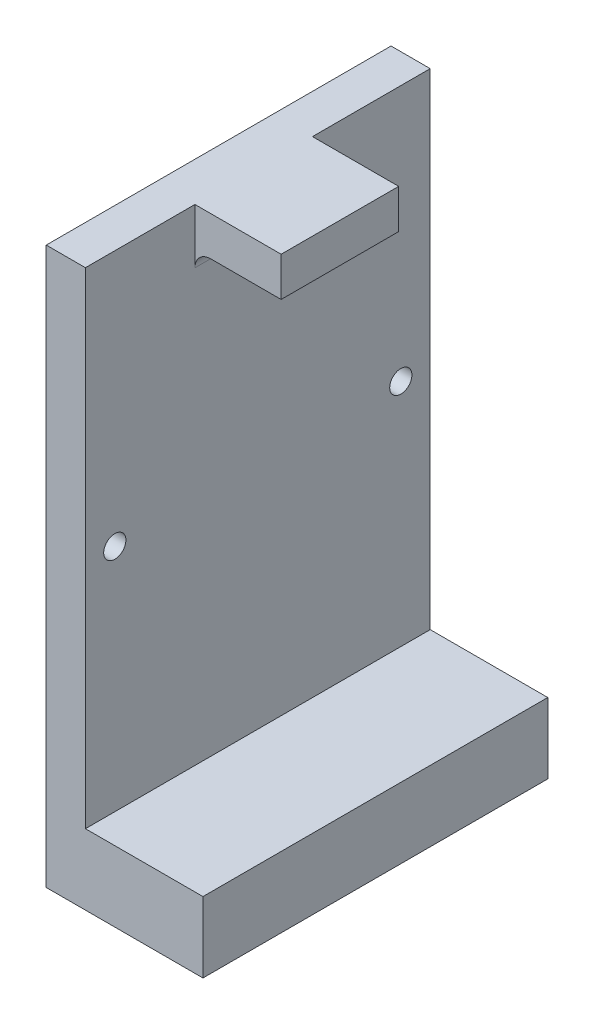
ISO-10303-21;
HEADER;
FILE_DESCRIPTION(('STEP AP214'),'2;1');
FILE_NAME('part.step','',(''),(''),'','','');
FILE_SCHEMA(('AUTOMOTIVE_DESIGN { 1 0 10303 214 1 1 1 1 }'));
ENDSEC;
DATA;
#1=APPLICATION_CONTEXT('core data for automotive mechanical design processes');
#2=APPLICATION_PROTOCOL_DEFINITION('international standard','automotive_design',2000,#1);
#3=PRODUCT_CONTEXT('',#1,'mechanical');
#4=PRODUCT('Part','Part','',(#3));
#5=PRODUCT_RELATED_PRODUCT_CATEGORY('part','',(#4));
#6=PRODUCT_DEFINITION_FORMATION('','',#4);
#7=PRODUCT_DEFINITION_CONTEXT('part definition',#1,'design');
#8=PRODUCT_DEFINITION('design','',#6,#7);
#9=PRODUCT_DEFINITION_SHAPE('','',#8);
#10=(LENGTH_UNIT() NAMED_UNIT(*) SI_UNIT(.MILLI.,.METRE.));
#11=(NAMED_UNIT(*) PLANE_ANGLE_UNIT() SI_UNIT($,.RADIAN.));
#12=(NAMED_UNIT(*) SI_UNIT($,.STERADIAN.) SOLID_ANGLE_UNIT());
#13=UNCERTAINTY_MEASURE_WITH_UNIT(LENGTH_MEASURE(1.E-05),#10,'distance_accuracy_value','');
#14=(GEOMETRIC_REPRESENTATION_CONTEXT(3) GLOBAL_UNCERTAINTY_ASSIGNED_CONTEXT((#13)) GLOBAL_UNIT_ASSIGNED_CONTEXT((#10,
#11,#12)) REPRESENTATION_CONTEXT('',''));
#15=CARTESIAN_POINT('',(0.,0.,0.));
#16=DIRECTION('',(0.,0.,1.));
#17=DIRECTION('',(1.,0.,0.));
#18=AXIS2_PLACEMENT_3D('',#15,#16,#17);
#19=CARTESIAN_POINT('',(-19.05,90.17,-55.88));
#20=DIRECTION('',(-1.,0.,0.));
#21=DIRECTION('',(0.,0.,1.));
#22=AXIS2_PLACEMENT_3D('',#19,#20,#21);
#23=PLANE('',#22);
#24=CARTESIAN_POINT('',(-19.05,48.6672764806341,-4.7625));
#25=DIRECTION('',(1.,0.,0.));
#26=DIRECTION('',(0.,0.,-1.));
#27=AXIS2_PLACEMENT_3D('',#24,#25,#26);
#28=CIRCLE('',#27,1.8);
#29=CARTESIAN_POINT('',(-19.05,48.6672764806341,-6.5625));
#30=VERTEX_POINT('',#29);
#31=EDGE_CURVE('E310',#30,#30,#28,.T.);
#32=ORIENTED_EDGE('',*,*,#31,.F.);
#33=EDGE_LOOP('',(#32));
#34=FACE_BOUND('',#33,.T.);
#35=DIRECTION('',(0.,1.,0.));
#36=VECTOR('',#35,1.);
#37=CARTESIAN_POINT('',(-19.05,90.17,-36.7994645969766));
#38=LINE('',#37,#36);
#39=CARTESIAN_POINT('',(-19.05,81.28,-36.7994645969766));
#40=VERTEX_POINT('',#39);
#41=CARTESIAN_POINT('',(-19.05,90.17,-36.7994645969766));
#42=VERTEX_POINT('',#41);
#43=EDGE_CURVE('E58',#40,#42,#38,.T.);
#44=ORIENTED_EDGE('',*,*,#43,.F.);
#45=DIRECTION('',(0.,0.,-1.));
#46=VECTOR('',#45,1.);
#47=CARTESIAN_POINT('',(-19.05,81.28,-17.7494645969766));
#48=LINE('',#47,#46);
#49=CARTESIAN_POINT('',(-19.05,81.28,-17.7494645969766));
#50=VERTEX_POINT('',#49);
#51=EDGE_CURVE('E228',#40,#50,#48,.F.);
#52=ORIENTED_EDGE('',*,*,#51,.T.);
#53=DIRECTION('',(0.,-1.,0.));
#54=VECTOR('',#53,1.);
#55=CARTESIAN_POINT('',(-19.05,90.17,-17.7494645969766));
#56=LINE('',#55,#54);
#57=CARTESIAN_POINT('',(-19.05,90.17,-17.7494645969766));
#58=VERTEX_POINT('',#57);
#59=EDGE_CURVE('E65',#58,#50,#56,.T.);
#60=ORIENTED_EDGE('',*,*,#59,.F.);
#61=DIRECTION('',(0.,0.,-1.));
#62=VECTOR('',#61,1.);
#63=CARTESIAN_POINT('',(-19.05,90.17,-55.88));
#64=LINE('',#63,#62);
#65=CARTESIAN_POINT('',(-19.05,90.17,0.));
#66=VERTEX_POINT('',#65);
#67=EDGE_CURVE('E170',#66,#58,#64,.T.);
#68=ORIENTED_EDGE('',*,*,#67,.F.);
#69=DIRECTION('',(0.,-1.,0.));
#70=VECTOR('',#69,1.);
#71=CARTESIAN_POINT('',(-19.05,90.17,0.));
#72=LINE('',#71,#70);
#73=CARTESIAN_POINT('',(-19.05,11.43,0.));
#74=VERTEX_POINT('',#73);
#75=EDGE_CURVE('E182',#66,#74,#72,.T.);
#76=ORIENTED_EDGE('',*,*,#75,.T.);
#77=DIRECTION('',(0.,0.,-1.));
#78=VECTOR('',#77,1.);
#79=CARTESIAN_POINT('',(-19.05,11.43,-55.88));
#80=LINE('',#79,#78);
#81=CARTESIAN_POINT('',(-19.05,11.43,-55.88));
#82=VERTEX_POINT('',#81);
#83=EDGE_CURVE('E151',#74,#82,#80,.T.);
#84=ORIENTED_EDGE('',*,*,#83,.T.);
#85=DIRECTION('',(0.,-1.,0.));
#86=VECTOR('',#85,1.);
#87=CARTESIAN_POINT('',(-19.05,90.17,-55.88));
#88=LINE('',#87,#86);
#89=CARTESIAN_POINT('',(-19.05,90.17,-55.88));
#90=VERTEX_POINT('',#89);
#91=EDGE_CURVE('E177',#90,#82,#88,.T.);
#92=ORIENTED_EDGE('',*,*,#91,.F.);
#93=EDGE_CURVE('E169',#42,#90,#64,.T.);
#94=ORIENTED_EDGE('',*,*,#93,.F.);
#95=EDGE_LOOP('',(#44,#52,#60,#68,#76,#84,#92,#94));
#96=FACE_BOUND('',#95,.T.);
#97=CARTESIAN_POINT('',(-19.05,48.6672764806341,-51.1175));
#98=DIRECTION('',(1.,0.,0.));
#99=DIRECTION('',(0.,0.,-1.));
#100=AXIS2_PLACEMENT_3D('',#97,#98,#99);
#101=CIRCLE('',#100,1.8);
#102=CARTESIAN_POINT('',(-19.05,48.6672764806341,-52.9175));
#103=VERTEX_POINT('',#102);
#104=EDGE_CURVE('E315',#103,#103,#101,.T.);
#105=ORIENTED_EDGE('',*,*,#104,.F.);
#106=EDGE_LOOP('',(#105));
#107=FACE_BOUND('',#106,.T.);
#108=ADVANCED_FACE('F42',(#34,#96,#107),#23,.F.);
#109=CARTESIAN_POINT('',(0.,11.43,0.));
#110=DIRECTION('',(-1.,0.,0.));
#111=DIRECTION('',(0.,0.,1.));
#112=AXIS2_PLACEMENT_3D('',#109,#110,#111);
#113=PLANE('',#112);
#114=DIRECTION('',(0.,0.,-1.));
#115=VECTOR('',#114,1.);
#116=CARTESIAN_POINT('',(0.,0.,0.));
#117=LINE('',#116,#115);
#118=CARTESIAN_POINT('',(0.,0.,0.));
#119=VERTEX_POINT('',#118);
#120=CARTESIAN_POINT('',(0.,0.,-55.88));
#121=VERTEX_POINT('',#120);
#122=EDGE_CURVE('E186',#119,#121,#117,.T.);
#123=ORIENTED_EDGE('',*,*,#122,.T.);
#124=DIRECTION('',(0.,-1.,0.));
#125=VECTOR('',#124,1.);
#126=CARTESIAN_POINT('',(0.,11.43,-55.88));
#127=LINE('',#126,#125);
#128=CARTESIAN_POINT('',(0.,11.43,-55.88));
#129=VERTEX_POINT('',#128);
#130=EDGE_CURVE('E221',#129,#121,#127,.T.);
#131=ORIENTED_EDGE('',*,*,#130,.F.);
#132=DIRECTION('',(0.,0.,-1.));
#133=VECTOR('',#132,1.);
#134=CARTESIAN_POINT('',(0.,11.43,0.));
#135=LINE('',#134,#133);
#136=CARTESIAN_POINT('',(0.,11.43,0.));
#137=VERTEX_POINT('',#136);
#138=EDGE_CURVE('E187',#137,#129,#135,.T.);
#139=ORIENTED_EDGE('',*,*,#138,.F.);
#140=DIRECTION('',(0.,-1.,0.));
#141=VECTOR('',#140,1.);
#142=CARTESIAN_POINT('',(0.,11.43,0.));
#143=LINE('',#142,#141);
#144=EDGE_CURVE('E198',#137,#119,#143,.T.);
#145=ORIENTED_EDGE('',*,*,#144,.T.);
#146=EDGE_LOOP('',(#123,#131,#139,#145));
#147=FACE_BOUND('',#146,.T.);
#148=ADVANCED_FACE('F266',(#147),#113,.F.);
#149=CARTESIAN_POINT('',(0.,11.43,-55.88));
#150=DIRECTION('',(0.,0.,1.));
#151=DIRECTION('',(1.,0.,0.));
#152=AXIS2_PLACEMENT_3D('',#149,#150,#151);
#153=PLANE('',#152);
#154=DIRECTION('',(-1.,0.,0.));
#155=VECTOR('',#154,1.);
#156=CARTESIAN_POINT('',(0.,0.,-55.88));
#157=LINE('',#156,#155);
#158=CARTESIAN_POINT('',(-25.4,0.,-55.88));
#159=VERTEX_POINT('',#158);
#160=EDGE_CURVE('E202',#121,#159,#157,.T.);
#161=ORIENTED_EDGE('',*,*,#160,.T.);
#162=DIRECTION('',(0.,-1.,0.));
#163=VECTOR('',#162,1.);
#164=CARTESIAN_POINT('',(-25.4,11.43,-55.88));
#165=LINE('',#164,#163);
#166=CARTESIAN_POINT('',(-25.4,90.17,-55.88));
#167=VERTEX_POINT('',#166);
#168=EDGE_CURVE('E217',#167,#159,#165,.T.);
#169=ORIENTED_EDGE('',*,*,#168,.F.);
#170=DIRECTION('',(-1.,0.,0.));
#171=VECTOR('',#170,1.);
#172=CARTESIAN_POINT('',(-25.4,90.17,-55.88));
#173=LINE('',#172,#171);
#174=EDGE_CURVE('E174',#90,#167,#173,.T.);
#175=ORIENTED_EDGE('',*,*,#174,.F.);
#176=ORIENTED_EDGE('',*,*,#91,.T.);
#177=DIRECTION('',(-1.,0.,0.));
#178=VECTOR('',#177,1.);
#179=CARTESIAN_POINT('',(0.,11.43,-55.88));
#180=LINE('',#179,#178);
#181=EDGE_CURVE('E191',#129,#82,#180,.T.);
#182=ORIENTED_EDGE('',*,*,#181,.F.);
#183=ORIENTED_EDGE('',*,*,#130,.T.);
#184=EDGE_LOOP('',(#161,#169,#175,#176,#182,#183));
#185=FACE_BOUND('',#184,.T.);
#186=ADVANCED_FACE('F256',(#185),#153,.F.);
#187=CARTESIAN_POINT('',(-25.4,11.43,0.));
#188=DIRECTION('',(1.,0.,0.));
#189=DIRECTION('',(0.,0.,-1.));
#190=AXIS2_PLACEMENT_3D('',#187,#188,#189);
#191=PLANE('',#190);
#192=CARTESIAN_POINT('',(-25.4,48.6672764806341,-4.7625));
#193=DIRECTION('',(1.,0.,0.));
#194=DIRECTION('',(0.,0.,-1.));
#195=AXIS2_PLACEMENT_3D('',#192,#193,#194);
#196=CIRCLE('',#195,1.8);
#197=CARTESIAN_POINT('',(-25.4,48.6672764806341,-6.5625));
#198=VERTEX_POINT('',#197);
#199=EDGE_CURVE('E308',#198,#198,#196,.T.);
#200=ORIENTED_EDGE('',*,*,#199,.T.);
#201=EDGE_LOOP('',(#200));
#202=FACE_BOUND('',#201,.T.);
#203=CARTESIAN_POINT('',(-25.4,48.6672764806341,-51.1175));
#204=DIRECTION('',(1.,0.,0.));
#205=DIRECTION('',(0.,0.,-1.));
#206=AXIS2_PLACEMENT_3D('',#203,#204,#205);
#207=CIRCLE('',#206,1.8);
#208=CARTESIAN_POINT('',(-25.4,48.6672764806341,-52.9175));
#209=VERTEX_POINT('',#208);
#210=EDGE_CURVE('E240',#209,#209,#207,.T.);
#211=ORIENTED_EDGE('',*,*,#210,.T.);
#212=EDGE_LOOP('',(#211));
#213=FACE_BOUND('',#212,.T.);
#214=DIRECTION('',(0.,0.,1.));
#215=VECTOR('',#214,1.);
#216=CARTESIAN_POINT('',(-25.4,0.,0.));
#217=LINE('',#216,#215);
#218=CARTESIAN_POINT('',(-25.4,0.,0.));
#219=VERTEX_POINT('',#218);
#220=EDGE_CURVE('E205',#159,#219,#217,.T.);
#221=ORIENTED_EDGE('',*,*,#220,.T.);
#222=DIRECTION('',(0.,-1.,0.));
#223=VECTOR('',#222,1.);
#224=CARTESIAN_POINT('',(-25.4,11.43,0.));
#225=LINE('',#224,#223);
#226=CARTESIAN_POINT('',(-25.4,90.17,0.));
#227=VERTEX_POINT('',#226);
#228=EDGE_CURVE('E213',#227,#219,#225,.T.);
#229=ORIENTED_EDGE('',*,*,#228,.F.);
#230=DIRECTION('',(0.,0.,1.));
#231=VECTOR('',#230,1.);
#232=CARTESIAN_POINT('',(-25.4,90.17,-55.88));
#233=LINE('',#232,#231);
#234=EDGE_CURVE('E157',#167,#227,#233,.T.);
#235=ORIENTED_EDGE('',*,*,#234,.F.);
#236=ORIENTED_EDGE('',*,*,#168,.T.);
#237=EDGE_LOOP('',(#221,#229,#235,#236));
#238=FACE_BOUND('',#237,.T.);
#239=ADVANCED_FACE('F258',(#202,#213,#238),#191,.F.);
#240=CARTESIAN_POINT('',(0.,11.43,0.));
#241=DIRECTION('',(0.,0.,-1.));
#242=DIRECTION('',(-1.,0.,0.));
#243=AXIS2_PLACEMENT_3D('',#240,#241,#242);
#244=PLANE('',#243);
#245=DIRECTION('',(1.,0.,0.));
#246=VECTOR('',#245,1.);
#247=CARTESIAN_POINT('',(0.,0.,0.));
#248=LINE('',#247,#246);
#249=EDGE_CURVE('E192',#219,#119,#248,.T.);
#250=ORIENTED_EDGE('',*,*,#249,.T.);
#251=ORIENTED_EDGE('',*,*,#144,.F.);
#252=DIRECTION('',(1.,0.,0.));
#253=VECTOR('',#252,1.);
#254=CARTESIAN_POINT('',(0.,11.43,0.));
#255=LINE('',#254,#253);
#256=EDGE_CURVE('E195',#74,#137,#255,.T.);
#257=ORIENTED_EDGE('',*,*,#256,.F.);
#258=ORIENTED_EDGE('',*,*,#75,.F.);
#259=DIRECTION('',(1.,0.,0.));
#260=VECTOR('',#259,1.);
#261=CARTESIAN_POINT('',(-25.4,90.17,0.));
#262=LINE('',#261,#260);
#263=EDGE_CURVE('E166',#227,#66,#262,.T.);
#264=ORIENTED_EDGE('',*,*,#263,.F.);
#265=ORIENTED_EDGE('',*,*,#228,.T.);
#266=EDGE_LOOP('',(#250,#251,#257,#258,#264,#265));
#267=FACE_BOUND('',#266,.T.);
#268=ADVANCED_FACE('F250',(#267),#244,.F.);
#269=CARTESIAN_POINT('',(0.,11.43,0.));
#270=DIRECTION('',(0.,1.,0.));
#271=DIRECTION('',(0.,0.,1.));
#272=AXIS2_PLACEMENT_3D('',#269,#270,#271);
#273=PLANE('',#272);
#274=ORIENTED_EDGE('',*,*,#83,.F.);
#275=ORIENTED_EDGE('',*,*,#256,.T.);
#276=ORIENTED_EDGE('',*,*,#138,.T.);
#277=ORIENTED_EDGE('',*,*,#181,.T.);
#278=EDGE_LOOP('',(#274,#275,#276,#277));
#279=FACE_BOUND('',#278,.T.);
#280=ADVANCED_FACE('F268',(#279),#273,.T.);
#281=CARTESIAN_POINT('',(0.,0.,0.));
#282=DIRECTION('',(0.,1.,0.));
#283=DIRECTION('',(0.,0.,1.));
#284=AXIS2_PLACEMENT_3D('',#281,#282,#283);
#285=PLANE('',#284);
#286=ORIENTED_EDGE('',*,*,#122,.F.);
#287=ORIENTED_EDGE('',*,*,#249,.F.);
#288=ORIENTED_EDGE('',*,*,#220,.F.);
#289=ORIENTED_EDGE('',*,*,#160,.F.);
#290=EDGE_LOOP('',(#286,#287,#288,#289));
#291=FACE_BOUND('',#290,.T.);
#292=ADVANCED_FACE('F263',(#291),#285,.F.);
#293=CARTESIAN_POINT('',(0.,90.17,0.));
#294=DIRECTION('',(0.,1.,0.));
#295=DIRECTION('',(0.,0.,1.));
#296=AXIS2_PLACEMENT_3D('',#293,#294,#295);
#297=PLANE('',#296);
#298=ORIENTED_EDGE('',*,*,#234,.T.);
#299=ORIENTED_EDGE('',*,*,#263,.T.);
#300=ORIENTED_EDGE('',*,*,#67,.T.);
#301=DIRECTION('',(-1.,0.,0.));
#302=VECTOR('',#301,1.);
#303=CARTESIAN_POINT('',(-5.07999999999999,90.17,-17.7494645969766));
#304=LINE('',#303,#302);
#305=CARTESIAN_POINT('',(-5.07999999999999,90.17,-17.7494645969766));
#306=VERTEX_POINT('',#305);
#307=EDGE_CURVE('E244',#306,#58,#304,.T.);
#308=ORIENTED_EDGE('',*,*,#307,.F.);
#309=DIRECTION('',(0.,0.,1.));
#310=VECTOR('',#309,1.);
#311=CARTESIAN_POINT('',(-5.07999999999999,90.17,-17.7494645969766));
#312=LINE('',#311,#310);
#313=CARTESIAN_POINT('',(-5.08,90.17,-36.7994645969766));
#314=VERTEX_POINT('',#313);
#315=EDGE_CURVE('E144',#314,#306,#312,.T.);
#316=ORIENTED_EDGE('',*,*,#315,.F.);
#317=DIRECTION('',(-1.,0.,0.));
#318=VECTOR('',#317,1.);
#319=CARTESIAN_POINT('',(-5.08,90.17,-36.7994645969766));
#320=LINE('',#319,#318);
#321=EDGE_CURVE('E159',#314,#42,#320,.T.);
#322=ORIENTED_EDGE('',*,*,#321,.T.);
#323=ORIENTED_EDGE('',*,*,#93,.T.);
#324=ORIENTED_EDGE('',*,*,#174,.T.);
#325=EDGE_LOOP('',(#298,#299,#300,#308,#316,#322,#323,#324));
#326=FACE_BOUND('',#325,.T.);
#327=ADVANCED_FACE('F243',(#326),#297,.T.);
#328=CARTESIAN_POINT('',(-5.07999999999999,90.17,-17.7494645969766));
#329=DIRECTION('',(0.,0.,-1.));
#330=DIRECTION('',(-1.,0.,0.));
#331=AXIS2_PLACEMENT_3D('',#328,#329,#330);
#332=PLANE('',#331);
#333=ORIENTED_EDGE('',*,*,#59,.T.);
#334=CARTESIAN_POINT('',(-16.51,81.28,-17.7494645969766));
#335=DIRECTION('',(0.,0.,-1.));
#336=DIRECTION('',(-1.,0.,0.));
#337=AXIS2_PLACEMENT_3D('',#334,#335,#336);
#338=CIRCLE('',#337,2.54);
#339=CARTESIAN_POINT('',(-16.51,83.82,-17.7494645969766));
#340=VERTEX_POINT('',#339);
#341=EDGE_CURVE('E11',#50,#340,#338,.T.);
#342=ORIENTED_EDGE('',*,*,#341,.T.);
#343=DIRECTION('',(-1.,0.,0.));
#344=VECTOR('',#343,1.);
#345=CARTESIAN_POINT('',(-5.07999999999999,83.82,-17.7494645969766));
#346=LINE('',#345,#344);
#347=CARTESIAN_POINT('',(-5.07999999999999,83.82,-17.7494645969766));
#348=VERTEX_POINT('',#347);
#349=EDGE_CURVE('E131',#348,#340,#346,.T.);
#350=ORIENTED_EDGE('',*,*,#349,.F.);
#351=DIRECTION('',(0.,-1.,0.));
#352=VECTOR('',#351,1.);
#353=CARTESIAN_POINT('',(-5.07999999999999,90.17,-17.7494645969766));
#354=LINE('',#353,#352);
#355=EDGE_CURVE('E139',#306,#348,#354,.T.);
#356=ORIENTED_EDGE('',*,*,#355,.F.);
#357=ORIENTED_EDGE('',*,*,#307,.T.);
#358=EDGE_LOOP('',(#333,#342,#350,#356,#357));
#359=FACE_BOUND('',#358,.T.);
#360=ADVANCED_FACE('F148',(#359),#332,.F.);
#361=CARTESIAN_POINT('',(-5.07999999999999,83.82,-17.7494645969766));
#362=DIRECTION('',(0.,1.,0.));
#363=DIRECTION('',(0.,0.,1.));
#364=AXIS2_PLACEMENT_3D('',#361,#362,#363);
#365=PLANE('',#364);
#366=ORIENTED_EDGE('',*,*,#349,.T.);
#367=DIRECTION('',(0.,0.,-1.));
#368=VECTOR('',#367,1.);
#369=CARTESIAN_POINT('',(-16.51,83.82,-36.7994645969766));
#370=LINE('',#369,#368);
#371=CARTESIAN_POINT('',(-16.51,83.82,-36.7994645969766));
#372=VERTEX_POINT('',#371);
#373=EDGE_CURVE('E225',#340,#372,#370,.T.);
#374=ORIENTED_EDGE('',*,*,#373,.T.);
#375=DIRECTION('',(-1.,0.,0.));
#376=VECTOR('',#375,1.);
#377=CARTESIAN_POINT('',(-5.08,83.82,-36.7994645969766));
#378=LINE('',#377,#376);
#379=CARTESIAN_POINT('',(-5.08,83.82,-36.7994645969766));
#380=VERTEX_POINT('',#379);
#381=EDGE_CURVE('E134',#380,#372,#378,.T.);
#382=ORIENTED_EDGE('',*,*,#381,.F.);
#383=DIRECTION('',(0.,0.,-1.));
#384=VECTOR('',#383,1.);
#385=CARTESIAN_POINT('',(-5.07999999999999,83.82,-17.7494645969766));
#386=LINE('',#385,#384);
#387=EDGE_CURVE('E126',#348,#380,#386,.T.);
#388=ORIENTED_EDGE('',*,*,#387,.F.);
#389=EDGE_LOOP('',(#366,#374,#382,#388));
#390=FACE_BOUND('',#389,.T.);
#391=ADVANCED_FACE('F128',(#390),#365,.F.);
#392=CARTESIAN_POINT('',(-5.08,90.17,-36.7994645969766));
#393=DIRECTION('',(0.,0.,1.));
#394=DIRECTION('',(1.,0.,0.));
#395=AXIS2_PLACEMENT_3D('',#392,#393,#394);
#396=PLANE('',#395);
#397=ORIENTED_EDGE('',*,*,#43,.T.);
#398=ORIENTED_EDGE('',*,*,#321,.F.);
#399=DIRECTION('',(0.,1.,0.));
#400=VECTOR('',#399,1.);
#401=CARTESIAN_POINT('',(-5.08,90.17,-36.7994645969766));
#402=LINE('',#401,#400);
#403=EDGE_CURVE('E138',#380,#314,#402,.T.);
#404=ORIENTED_EDGE('',*,*,#403,.F.);
#405=ORIENTED_EDGE('',*,*,#381,.T.);
#406=CARTESIAN_POINT('',(-16.51,81.28,-36.7994645969766));
#407=DIRECTION('',(0.,0.,1.));
#408=DIRECTION('',(1.,0.,0.));
#409=AXIS2_PLACEMENT_3D('',#406,#407,#408);
#410=CIRCLE('',#409,2.54);
#411=EDGE_CURVE('E51',#372,#40,#410,.T.);
#412=ORIENTED_EDGE('',*,*,#411,.T.);
#413=EDGE_LOOP('',(#397,#398,#404,#405,#412));
#414=FACE_BOUND('',#413,.T.);
#415=ADVANCED_FACE('F234',(#414),#396,.F.);
#416=CARTESIAN_POINT('',(-5.07999999999999,0.,0.));
#417=DIRECTION('',(1.,0.,0.));
#418=DIRECTION('',(0.,0.,-1.));
#419=AXIS2_PLACEMENT_3D('',#416,#417,#418);
#420=PLANE('',#419);
#421=ORIENTED_EDGE('',*,*,#355,.T.);
#422=ORIENTED_EDGE('',*,*,#387,.T.);
#423=ORIENTED_EDGE('',*,*,#403,.T.);
#424=ORIENTED_EDGE('',*,*,#315,.T.);
#425=EDGE_LOOP('',(#421,#422,#423,#424));
#426=FACE_BOUND('',#425,.T.);
#427=ADVANCED_FACE('F142',(#426),#420,.T.);
#428=CARTESIAN_POINT('',(-19.05,48.6672764806341,-51.1175));
#429=DIRECTION('',(1.,0.,0.));
#430=DIRECTION('',(0.,0.,-1.));
#431=AXIS2_PLACEMENT_3D('',#428,#429,#430);
#432=CYLINDRICAL_SURFACE('',#431,1.8);
#433=ORIENTED_EDGE('',*,*,#210,.F.);
#434=EDGE_LOOP('',(#433));
#435=FACE_BOUND('',#434,.T.);
#436=ORIENTED_EDGE('',*,*,#104,.T.);
#437=EDGE_LOOP('',(#436));
#438=FACE_BOUND('',#437,.T.);
#439=ADVANCED_FACE('F295',(#435,#438),#432,.F.);
#440=CARTESIAN_POINT('',(-19.05,48.6672764806341,-4.7625));
#441=DIRECTION('',(1.,0.,0.));
#442=DIRECTION('',(0.,0.,-1.));
#443=AXIS2_PLACEMENT_3D('',#440,#441,#442);
#444=CYLINDRICAL_SURFACE('',#443,1.8);
#445=ORIENTED_EDGE('',*,*,#199,.F.);
#446=EDGE_LOOP('',(#445));
#447=FACE_BOUND('',#446,.T.);
#448=ORIENTED_EDGE('',*,*,#31,.T.);
#449=EDGE_LOOP('',(#448));
#450=FACE_BOUND('',#449,.T.);
#451=ADVANCED_FACE('F298',(#447,#450),#444,.F.);
#452=CARTESIAN_POINT('',(-16.51,81.28,-17.7494645969766));
#453=DIRECTION('',(0.,0.,1.));
#454=DIRECTION('',(0.,-1.,0.));
#455=AXIS2_PLACEMENT_3D('',#452,#453,#454);
#456=CYLINDRICAL_SURFACE('',#455,2.54);
#457=ORIENTED_EDGE('',*,*,#341,.F.);
#458=ORIENTED_EDGE('',*,*,#51,.F.);
#459=ORIENTED_EDGE('',*,*,#411,.F.);
#460=ORIENTED_EDGE('',*,*,#373,.F.);
#461=EDGE_LOOP('',(#457,#458,#459,#460));
#462=FACE_BOUND('',#461,.T.);
#463=ADVANCED_FACE('F44',(#462),#456,.F.);
#464=CLOSED_SHELL('',(#108,#148,#186,#239,#268,#280,#292,#327,#360,#391,#415,#427,#439,#451,#463));
#465=MANIFOLD_SOLID_BREP('B2',#464);
#466=ADVANCED_BREP_SHAPE_REPRESENTATION('',(#18,#465),#14);
#467=SHAPE_DEFINITION_REPRESENTATION(#9,#466);
ENDSEC;
END-ISO-10303-21;
